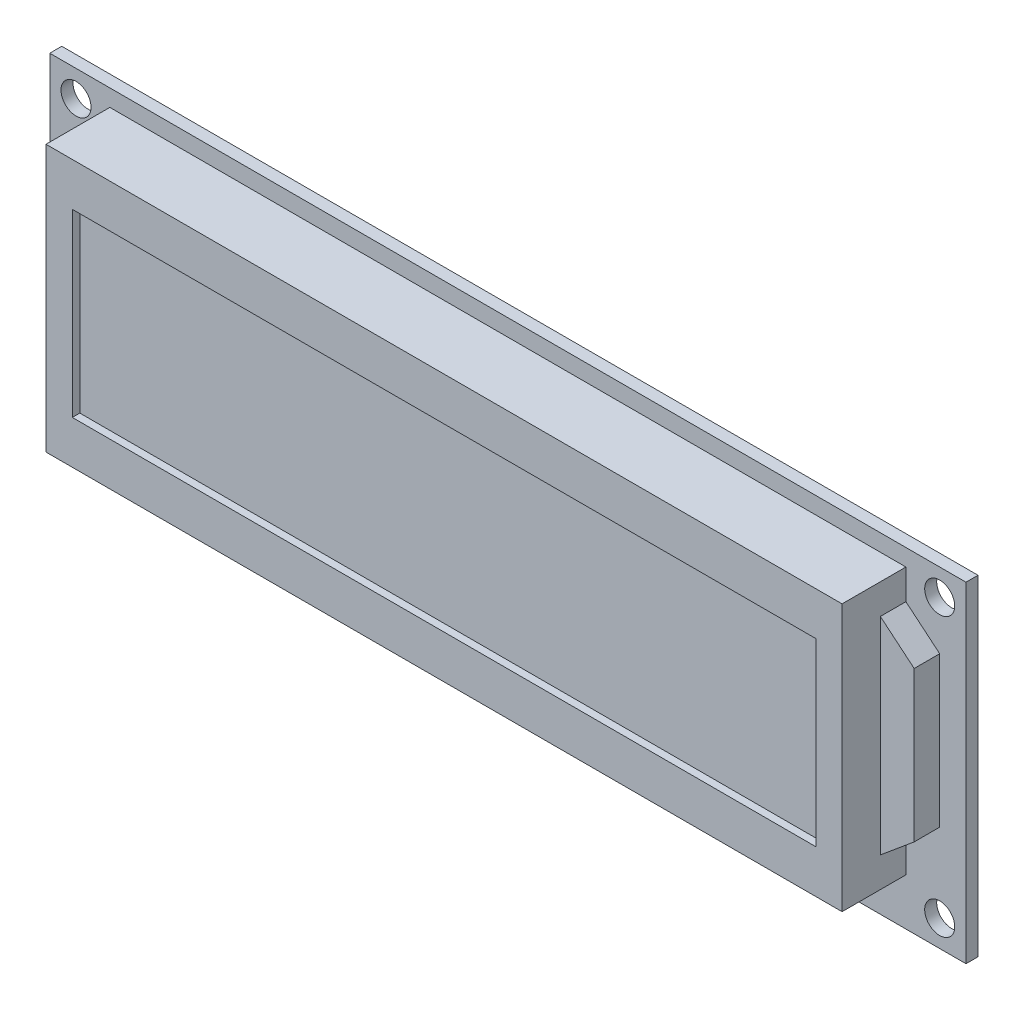
ISO-10303-21;
HEADER;
FILE_DESCRIPTION(('STEP AP214'),'2;1');
FILE_NAME('part.step','',(''),(''),'','','');
FILE_SCHEMA(('AUTOMOTIVE_DESIGN { 1 0 10303 214 1 1 1 1 }'));
ENDSEC;
DATA;
#1=APPLICATION_CONTEXT('core data for automotive mechanical design processes');
#2=APPLICATION_PROTOCOL_DEFINITION('international standard','automotive_design',2000,#1);
#3=PRODUCT_CONTEXT('',#1,'mechanical');
#4=PRODUCT('Part','Part','',(#3));
#5=PRODUCT_RELATED_PRODUCT_CATEGORY('part','',(#4));
#6=PRODUCT_DEFINITION_FORMATION('','',#4);
#7=PRODUCT_DEFINITION_CONTEXT('part definition',#1,'design');
#8=PRODUCT_DEFINITION('design','',#6,#7);
#9=PRODUCT_DEFINITION_SHAPE('','',#8);
#10=(LENGTH_UNIT() NAMED_UNIT(*) SI_UNIT(.MILLI.,.METRE.));
#11=(NAMED_UNIT(*) PLANE_ANGLE_UNIT() SI_UNIT($,.RADIAN.));
#12=(NAMED_UNIT(*) SI_UNIT($,.STERADIAN.) SOLID_ANGLE_UNIT());
#13=UNCERTAINTY_MEASURE_WITH_UNIT(LENGTH_MEASURE(1.E-05),#10,'distance_accuracy_value','');
#14=(GEOMETRIC_REPRESENTATION_CONTEXT(3) GLOBAL_UNCERTAINTY_ASSIGNED_CONTEXT((#13)) GLOBAL_UNIT_ASSIGNED_CONTEXT((#10,
#11,#12)) REPRESENTATION_CONTEXT('',''));
#15=CARTESIAN_POINT('',(0.,0.,0.));
#16=DIRECTION('',(0.,0.,1.));
#17=DIRECTION('',(1.,0.,0.));
#18=AXIS2_PLACEMENT_3D('',#15,#16,#17);
#19=CARTESIAN_POINT('',(0.,0.,1.6));
#20=DIRECTION('',(0.,0.,1.));
#21=DIRECTION('',(1.,0.,0.));
#22=AXIS2_PLACEMENT_3D('',#19,#20,#21);
#23=PLANE('',#22);
#24=CARTESIAN_POINT('',(57.5,18.5,1.6));
#25=DIRECTION('',(0.,0.,1.));
#26=DIRECTION('',(1.,0.,0.));
#27=AXIS2_PLACEMENT_3D('',#24,#25,#26);
#28=CIRCLE('',#27,2.);
#29=CARTESIAN_POINT('',(59.5,18.5,1.6));
#30=VERTEX_POINT('',#29);
#31=EDGE_CURVE('E240',#30,#30,#28,.T.);
#32=ORIENTED_EDGE('',*,*,#31,.F.);
#33=EDGE_LOOP('',(#32));
#34=FACE_BOUND('',#33,.T.);
#35=CARTESIAN_POINT('',(-57.5,18.5,1.6));
#36=DIRECTION('',(0.,0.,1.));
#37=DIRECTION('',(1.,0.,0.));
#38=AXIS2_PLACEMENT_3D('',#35,#36,#37);
#39=CIRCLE('',#38,2.);
#40=CARTESIAN_POINT('',(-55.5,18.5,1.6));
#41=VERTEX_POINT('',#40);
#42=EDGE_CURVE('E252',#41,#41,#39,.T.);
#43=ORIENTED_EDGE('',*,*,#42,.F.);
#44=EDGE_LOOP('',(#43));
#45=FACE_BOUND('',#44,.T.);
#46=DIRECTION('',(0.,-1.,0.));
#47=VECTOR('',#46,1.);
#48=CARTESIAN_POINT('',(-61.,-22.,1.6));
#49=LINE('',#48,#47);
#50=CARTESIAN_POINT('',(-61.,22.,1.6));
#51=VERTEX_POINT('',#50);
#52=CARTESIAN_POINT('',(-61.,-22.,1.6));
#53=VERTEX_POINT('',#52);
#54=EDGE_CURVE('E258',#51,#53,#49,.T.);
#55=ORIENTED_EDGE('',*,*,#54,.T.);
#56=DIRECTION('',(1.,0.,0.));
#57=VECTOR('',#56,1.);
#58=CARTESIAN_POINT('',(61.,-22.,1.6));
#59=LINE('',#58,#57);
#60=CARTESIAN_POINT('',(61.,-22.,1.6));
#61=VERTEX_POINT('',#60);
#62=EDGE_CURVE('E261',#53,#61,#59,.T.);
#63=ORIENTED_EDGE('',*,*,#62,.T.);
#64=DIRECTION('',(0.,1.,0.));
#65=VECTOR('',#64,1.);
#66=CARTESIAN_POINT('',(61.,-22.,1.6));
#67=LINE('',#66,#65);
#68=CARTESIAN_POINT('',(61.,22.,1.6));
#69=VERTEX_POINT('',#68);
#70=EDGE_CURVE('E264',#61,#69,#67,.T.);
#71=ORIENTED_EDGE('',*,*,#70,.T.);
#72=DIRECTION('',(-1.,0.,0.));
#73=VECTOR('',#72,1.);
#74=CARTESIAN_POINT('',(61.,22.,1.6));
#75=LINE('',#74,#73);
#76=EDGE_CURVE('E266',#69,#51,#75,.T.);
#77=ORIENTED_EDGE('',*,*,#76,.T.);
#78=EDGE_LOOP('',(#55,#63,#71,#77));
#79=FACE_BOUND('',#78,.T.);
#80=CARTESIAN_POINT('',(-57.5,-18.5,1.6));
#81=DIRECTION('',(0.,0.,1.));
#82=DIRECTION('',(1.,0.,0.));
#83=AXIS2_PLACEMENT_3D('',#80,#81,#82);
#84=CIRCLE('',#83,2.);
#85=CARTESIAN_POINT('',(-55.5,-18.5,1.6));
#86=VERTEX_POINT('',#85);
#87=EDGE_CURVE('E246',#86,#86,#84,.T.);
#88=ORIENTED_EDGE('',*,*,#87,.F.);
#89=EDGE_LOOP('',(#88));
#90=FACE_BOUND('',#89,.T.);
#91=CARTESIAN_POINT('',(57.5,-18.5,1.6));
#92=DIRECTION('',(0.,0.,1.));
#93=DIRECTION('',(1.,0.,0.));
#94=AXIS2_PLACEMENT_3D('',#91,#92,#93);
#95=CIRCLE('',#94,2.);
#96=CARTESIAN_POINT('',(59.5,-18.5,1.6));
#97=VERTEX_POINT('',#96);
#98=EDGE_CURVE('E234',#97,#97,#95,.T.);
#99=ORIENTED_EDGE('',*,*,#98,.F.);
#100=EDGE_LOOP('',(#99));
#101=FACE_BOUND('',#100,.T.);
#102=DIRECTION('',(0.,1.,0.));
#103=VECTOR('',#102,1.);
#104=CARTESIAN_POINT('',(53.,-15.75,1.6));
#105=LINE('',#104,#103);
#106=CARTESIAN_POINT('',(53.,15.75,1.6));
#107=VERTEX_POINT('',#106);
#108=CARTESIAN_POINT('',(53.,19.75,1.6));
#109=VERTEX_POINT('',#108);
#110=EDGE_CURVE('E221',#107,#109,#105,.T.);
#111=ORIENTED_EDGE('',*,*,#110,.F.);
#112=DIRECTION('',(-0.768221279597376,0.64018439966448,0.));
#113=VECTOR('',#112,1.);
#114=CARTESIAN_POINT('',(53.,15.75,1.6));
#115=LINE('',#114,#113);
#116=CARTESIAN_POINT('',(57.5,12.,1.6));
#117=VERTEX_POINT('',#116);
#118=EDGE_CURVE('E542',#117,#107,#115,.T.);
#119=ORIENTED_EDGE('',*,*,#118,.F.);
#120=DIRECTION('',(0.,1.,0.));
#121=VECTOR('',#120,1.);
#122=CARTESIAN_POINT('',(57.5,12.,1.6));
#123=LINE('',#122,#121);
#124=CARTESIAN_POINT('',(57.5,-8.,1.6));
#125=VERTEX_POINT('',#124);
#126=EDGE_CURVE('E536',#125,#117,#123,.T.);
#127=ORIENTED_EDGE('',*,*,#126,.F.);
#128=DIRECTION('',(0.768221279597376,0.64018439966448,0.));
#129=VECTOR('',#128,1.);
#130=CARTESIAN_POINT('',(53.,-11.75,1.6));
#131=LINE('',#130,#129);
#132=CARTESIAN_POINT('',(53.,-11.75,1.6));
#133=VERTEX_POINT('',#132);
#134=EDGE_CURVE('E540',#133,#125,#131,.T.);
#135=ORIENTED_EDGE('',*,*,#134,.F.);
#136=CARTESIAN_POINT('',(53.,-15.75,1.6));
#137=VERTEX_POINT('',#136);
#138=EDGE_CURVE('E168',#137,#133,#105,.T.);
#139=ORIENTED_EDGE('',*,*,#138,.F.);
#140=DIRECTION('',(1.,0.,0.));
#141=VECTOR('',#140,1.);
#142=CARTESIAN_POINT('',(53.,-15.75,1.6));
#143=LINE('',#142,#141);
#144=CARTESIAN_POINT('',(-53.,-15.75,1.6));
#145=VERTEX_POINT('',#144);
#146=EDGE_CURVE('E219',#145,#137,#143,.T.);
#147=ORIENTED_EDGE('',*,*,#146,.F.);
#148=DIRECTION('',(0.,-1.,0.));
#149=VECTOR('',#148,1.);
#150=CARTESIAN_POINT('',(-53.,-15.75,1.6));
#151=LINE('',#150,#149);
#152=CARTESIAN_POINT('',(-53.,19.75,1.6));
#153=VERTEX_POINT('',#152);
#154=EDGE_CURVE('E200',#153,#145,#151,.T.);
#155=ORIENTED_EDGE('',*,*,#154,.F.);
#156=DIRECTION('',(-1.,0.,0.));
#157=VECTOR('',#156,1.);
#158=CARTESIAN_POINT('',(53.,19.75,1.6));
#159=LINE('',#158,#157);
#160=EDGE_CURVE('E210',#109,#153,#159,.T.);
#161=ORIENTED_EDGE('',*,*,#160,.F.);
#162=EDGE_LOOP('',(#111,#119,#127,#135,#139,#147,#155,#161));
#163=FACE_BOUND('',#162,.T.);
#164=ADVANCED_FACE('F33',(#34,#45,#79,#90,#101,#163),#23,.T.);
#165=CARTESIAN_POINT('',(53.,-15.75,10.1));
#166=DIRECTION('',(-1.,0.,0.));
#167=DIRECTION('',(0.,-1.,0.));
#168=AXIS2_PLACEMENT_3D('',#165,#166,#167);
#169=PLANE('',#168);
#170=DIRECTION('',(0.,0.,-1.));
#171=VECTOR('',#170,1.);
#172=CARTESIAN_POINT('',(53.,15.75,5.));
#173=LINE('',#172,#171);
#174=CARTESIAN_POINT('',(53.,15.75,5.));
#175=VERTEX_POINT('',#174);
#176=EDGE_CURVE('E48',#175,#107,#173,.T.);
#177=ORIENTED_EDGE('',*,*,#176,.T.);
#178=ORIENTED_EDGE('',*,*,#110,.T.);
#179=DIRECTION('',(0.,0.,-1.));
#180=VECTOR('',#179,1.);
#181=CARTESIAN_POINT('',(53.,19.75,10.1));
#182=LINE('',#181,#180);
#183=CARTESIAN_POINT('',(53.,19.75,10.1));
#184=VERTEX_POINT('',#183);
#185=EDGE_CURVE('E226',#184,#109,#182,.T.);
#186=ORIENTED_EDGE('',*,*,#185,.F.);
#187=DIRECTION('',(0.,1.,0.));
#188=VECTOR('',#187,1.);
#189=CARTESIAN_POINT('',(53.,-15.75,10.1));
#190=LINE('',#189,#188);
#191=CARTESIAN_POINT('',(53.,-15.75,10.1));
#192=VERTEX_POINT('',#191);
#193=EDGE_CURVE('E212',#192,#184,#190,.T.);
#194=ORIENTED_EDGE('',*,*,#193,.F.);
#195=DIRECTION('',(0.,0.,-1.));
#196=VECTOR('',#195,1.);
#197=CARTESIAN_POINT('',(53.,-15.75,10.1));
#198=LINE('',#197,#196);
#199=EDGE_CURVE('E229',#192,#137,#198,.T.);
#200=ORIENTED_EDGE('',*,*,#199,.T.);
#201=ORIENTED_EDGE('',*,*,#138,.T.);
#202=DIRECTION('',(0.,0.,-1.));
#203=VECTOR('',#202,1.);
#204=CARTESIAN_POINT('',(53.,-11.75,5.));
#205=LINE('',#204,#203);
#206=CARTESIAN_POINT('',(53.,-11.75,5.));
#207=VERTEX_POINT('',#206);
#208=EDGE_CURVE('E157',#207,#133,#205,.T.);
#209=ORIENTED_EDGE('',*,*,#208,.F.);
#210=DIRECTION('',(0.,-1.,0.));
#211=VECTOR('',#210,1.);
#212=CARTESIAN_POINT('',(53.,15.75,5.));
#213=LINE('',#212,#211);
#214=EDGE_CURVE('E146',#175,#207,#213,.T.);
#215=ORIENTED_EDGE('',*,*,#214,.F.);
#216=EDGE_LOOP('',(#177,#178,#186,#194,#200,#201,#209,#215));
#217=FACE_BOUND('',#216,.T.);
#218=ADVANCED_FACE('F165',(#217),#169,.F.);
#219=CARTESIAN_POINT('',(0.,0.,0.));
#220=DIRECTION('',(0.,0.,1.));
#221=DIRECTION('',(1.,0.,0.));
#222=AXIS2_PLACEMENT_3D('',#219,#220,#221);
#223=PLANE('',#222);
#224=DIRECTION('',(0.,-1.,0.));
#225=VECTOR('',#224,1.);
#226=CARTESIAN_POINT('',(-61.,-22.,0.));
#227=LINE('',#226,#225);
#228=CARTESIAN_POINT('',(-61.,22.,0.));
#229=VERTEX_POINT('',#228);
#230=CARTESIAN_POINT('',(-61.,-22.,0.));
#231=VERTEX_POINT('',#230);
#232=EDGE_CURVE('E255',#229,#231,#227,.T.);
#233=ORIENTED_EDGE('',*,*,#232,.F.);
#234=DIRECTION('',(-1.,0.,0.));
#235=VECTOR('',#234,1.);
#236=CARTESIAN_POINT('',(61.,22.,0.));
#237=LINE('',#236,#235);
#238=CARTESIAN_POINT('',(61.,22.,0.));
#239=VERTEX_POINT('',#238);
#240=EDGE_CURVE('E262',#239,#229,#237,.T.);
#241=ORIENTED_EDGE('',*,*,#240,.F.);
#242=DIRECTION('',(0.,1.,0.));
#243=VECTOR('',#242,1.);
#244=CARTESIAN_POINT('',(61.,-22.,0.));
#245=LINE('',#244,#243);
#246=CARTESIAN_POINT('',(61.,-22.,0.));
#247=VERTEX_POINT('',#246);
#248=EDGE_CURVE('E273',#247,#239,#245,.T.);
#249=ORIENTED_EDGE('',*,*,#248,.F.);
#250=DIRECTION('',(1.,0.,0.));
#251=VECTOR('',#250,1.);
#252=CARTESIAN_POINT('',(61.,-22.,0.));
#253=LINE('',#252,#251);
#254=EDGE_CURVE('E271',#231,#247,#253,.T.);
#255=ORIENTED_EDGE('',*,*,#254,.F.);
#256=EDGE_LOOP('',(#233,#241,#249,#255));
#257=FACE_BOUND('',#256,.T.);
#258=CARTESIAN_POINT('',(-57.5,18.5,0.));
#259=DIRECTION('',(0.,0.,1.));
#260=DIRECTION('',(1.,0.,0.));
#261=AXIS2_PLACEMENT_3D('',#258,#259,#260);
#262=CIRCLE('',#261,2.);
#263=CARTESIAN_POINT('',(-55.5,18.5,0.));
#264=VERTEX_POINT('',#263);
#265=EDGE_CURVE('E249',#264,#264,#262,.T.);
#266=ORIENTED_EDGE('',*,*,#265,.T.);
#267=EDGE_LOOP('',(#266));
#268=FACE_BOUND('',#267,.T.);
#269=CARTESIAN_POINT('',(-57.5,-18.5,0.));
#270=DIRECTION('',(0.,0.,1.));
#271=DIRECTION('',(1.,0.,0.));
#272=AXIS2_PLACEMENT_3D('',#269,#270,#271);
#273=CIRCLE('',#272,2.);
#274=CARTESIAN_POINT('',(-55.5,-18.5,0.));
#275=VERTEX_POINT('',#274);
#276=EDGE_CURVE('E243',#275,#275,#273,.T.);
#277=ORIENTED_EDGE('',*,*,#276,.T.);
#278=EDGE_LOOP('',(#277));
#279=FACE_BOUND('',#278,.T.);
#280=CARTESIAN_POINT('',(57.5,18.5,0.));
#281=DIRECTION('',(0.,0.,1.));
#282=DIRECTION('',(1.,0.,0.));
#283=AXIS2_PLACEMENT_3D('',#280,#281,#282);
#284=CIRCLE('',#283,2.);
#285=CARTESIAN_POINT('',(59.5,18.5,0.));
#286=VERTEX_POINT('',#285);
#287=EDGE_CURVE('E237',#286,#286,#284,.T.);
#288=ORIENTED_EDGE('',*,*,#287,.T.);
#289=EDGE_LOOP('',(#288));
#290=FACE_BOUND('',#289,.T.);
#291=CARTESIAN_POINT('',(57.5,-18.5,0.));
#292=DIRECTION('',(0.,0.,1.));
#293=DIRECTION('',(1.,0.,0.));
#294=AXIS2_PLACEMENT_3D('',#291,#292,#293);
#295=CIRCLE('',#294,2.);
#296=CARTESIAN_POINT('',(59.5,-18.5,0.));
#297=VERTEX_POINT('',#296);
#298=EDGE_CURVE('E233',#297,#297,#295,.T.);
#299=ORIENTED_EDGE('',*,*,#298,.T.);
#300=EDGE_LOOP('',(#299));
#301=FACE_BOUND('',#300,.T.);
#302=ADVANCED_FACE('F291',(#257,#268,#279,#290,#301),#223,.F.);
#303=CARTESIAN_POINT('',(-61.,-22.,1.6));
#304=DIRECTION('',(1.,0.,0.));
#305=DIRECTION('',(0.,0.,-1.));
#306=AXIS2_PLACEMENT_3D('',#303,#304,#305);
#307=PLANE('',#306);
#308=ORIENTED_EDGE('',*,*,#232,.T.);
#309=DIRECTION('',(0.,0.,-1.));
#310=VECTOR('',#309,1.);
#311=CARTESIAN_POINT('',(-61.,-22.,1.6));
#312=LINE('',#311,#310);
#313=EDGE_CURVE('E11',#53,#231,#312,.T.);
#314=ORIENTED_EDGE('',*,*,#313,.F.);
#315=ORIENTED_EDGE('',*,*,#54,.F.);
#316=DIRECTION('',(0.,0.,-1.));
#317=VECTOR('',#316,1.);
#318=CARTESIAN_POINT('',(-61.,22.,1.6));
#319=LINE('',#318,#317);
#320=EDGE_CURVE('E268',#51,#229,#319,.T.);
#321=ORIENTED_EDGE('',*,*,#320,.T.);
#322=EDGE_LOOP('',(#308,#314,#315,#321));
#323=FACE_BOUND('',#322,.T.);
#324=ADVANCED_FACE('F35',(#323),#307,.F.);
#325=CARTESIAN_POINT('',(61.,-22.,1.6));
#326=DIRECTION('',(0.,1.,0.));
#327=DIRECTION('',(-1.,0.,0.));
#328=AXIS2_PLACEMENT_3D('',#325,#326,#327);
#329=PLANE('',#328);
#330=ORIENTED_EDGE('',*,*,#254,.T.);
#331=DIRECTION('',(0.,0.,-1.));
#332=VECTOR('',#331,1.);
#333=CARTESIAN_POINT('',(61.,-22.,1.6));
#334=LINE('',#333,#332);
#335=EDGE_CURVE('E41',#61,#247,#334,.T.);
#336=ORIENTED_EDGE('',*,*,#335,.F.);
#337=ORIENTED_EDGE('',*,*,#62,.F.);
#338=ORIENTED_EDGE('',*,*,#313,.T.);
#339=EDGE_LOOP('',(#330,#336,#337,#338));
#340=FACE_BOUND('',#339,.T.);
#341=ADVANCED_FACE('F302',(#340),#329,.F.);
#342=CARTESIAN_POINT('',(61.,-22.,1.6));
#343=DIRECTION('',(-1.,0.,0.));
#344=DIRECTION('',(0.,-1.,0.));
#345=AXIS2_PLACEMENT_3D('',#342,#343,#344);
#346=PLANE('',#345);
#347=ORIENTED_EDGE('',*,*,#248,.T.);
#348=DIRECTION('',(0.,0.,-1.));
#349=VECTOR('',#348,1.);
#350=CARTESIAN_POINT('',(61.,22.,1.6));
#351=LINE('',#350,#349);
#352=EDGE_CURVE('E278',#69,#239,#351,.T.);
#353=ORIENTED_EDGE('',*,*,#352,.F.);
#354=ORIENTED_EDGE('',*,*,#70,.F.);
#355=ORIENTED_EDGE('',*,*,#335,.T.);
#356=EDGE_LOOP('',(#347,#353,#354,#355));
#357=FACE_BOUND('',#356,.T.);
#358=ADVANCED_FACE('F285',(#357),#346,.F.);
#359=CARTESIAN_POINT('',(61.,22.,1.6));
#360=DIRECTION('',(0.,-1.,0.));
#361=DIRECTION('',(1.,0.,0.));
#362=AXIS2_PLACEMENT_3D('',#359,#360,#361);
#363=PLANE('',#362);
#364=ORIENTED_EDGE('',*,*,#240,.T.);
#365=ORIENTED_EDGE('',*,*,#320,.F.);
#366=ORIENTED_EDGE('',*,*,#76,.F.);
#367=ORIENTED_EDGE('',*,*,#352,.T.);
#368=EDGE_LOOP('',(#364,#365,#366,#367));
#369=FACE_BOUND('',#368,.T.);
#370=ADVANCED_FACE('F295',(#369),#363,.F.);
#371=CARTESIAN_POINT('',(-57.5,18.5,1.6));
#372=DIRECTION('',(0.,0.,-1.));
#373=DIRECTION('',(-1.,0.,0.));
#374=AXIS2_PLACEMENT_3D('',#371,#372,#373);
#375=CYLINDRICAL_SURFACE('',#374,2.);
#376=ORIENTED_EDGE('',*,*,#42,.T.);
#377=EDGE_LOOP('',(#376));
#378=FACE_BOUND('',#377,.T.);
#379=ORIENTED_EDGE('',*,*,#265,.F.);
#380=EDGE_LOOP('',(#379));
#381=FACE_BOUND('',#380,.T.);
#382=ADVANCED_FACE('F320',(#378,#381),#375,.F.);
#383=CARTESIAN_POINT('',(-57.5,-18.5,1.6));
#384=DIRECTION('',(0.,0.,-1.));
#385=DIRECTION('',(-1.,0.,0.));
#386=AXIS2_PLACEMENT_3D('',#383,#384,#385);
#387=CYLINDRICAL_SURFACE('',#386,2.);
#388=ORIENTED_EDGE('',*,*,#87,.T.);
#389=EDGE_LOOP('',(#388));
#390=FACE_BOUND('',#389,.T.);
#391=ORIENTED_EDGE('',*,*,#276,.F.);
#392=EDGE_LOOP('',(#391));
#393=FACE_BOUND('',#392,.T.);
#394=ADVANCED_FACE('F328',(#390,#393),#387,.F.);
#395=CARTESIAN_POINT('',(57.5,18.5,1.6));
#396=DIRECTION('',(0.,0.,-1.));
#397=DIRECTION('',(-1.,0.,0.));
#398=AXIS2_PLACEMENT_3D('',#395,#396,#397);
#399=CYLINDRICAL_SURFACE('',#398,2.);
#400=ORIENTED_EDGE('',*,*,#31,.T.);
#401=EDGE_LOOP('',(#400));
#402=FACE_BOUND('',#401,.T.);
#403=ORIENTED_EDGE('',*,*,#287,.F.);
#404=EDGE_LOOP('',(#403));
#405=FACE_BOUND('',#404,.T.);
#406=ADVANCED_FACE('F333',(#402,#405),#399,.F.);
#407=CARTESIAN_POINT('',(57.5,-18.5,1.6));
#408=DIRECTION('',(0.,0.,-1.));
#409=DIRECTION('',(-1.,0.,0.));
#410=AXIS2_PLACEMENT_3D('',#407,#408,#409);
#411=CYLINDRICAL_SURFACE('',#410,2.);
#412=ORIENTED_EDGE('',*,*,#98,.T.);
#413=EDGE_LOOP('',(#412));
#414=FACE_BOUND('',#413,.T.);
#415=ORIENTED_EDGE('',*,*,#298,.F.);
#416=EDGE_LOOP('',(#415));
#417=FACE_BOUND('',#416,.T.);
#418=ADVANCED_FACE('F345',(#414,#417),#411,.F.);
#419=CARTESIAN_POINT('',(-53.,-15.75,10.1));
#420=DIRECTION('',(1.,0.,0.));
#421=DIRECTION('',(0.,0.,-1.));
#422=AXIS2_PLACEMENT_3D('',#419,#420,#421);
#423=PLANE('',#422);
#424=ORIENTED_EDGE('',*,*,#154,.T.);
#425=DIRECTION('',(0.,0.,-1.));
#426=VECTOR('',#425,1.);
#427=CARTESIAN_POINT('',(-53.,-15.75,10.1));
#428=LINE('',#427,#426);
#429=CARTESIAN_POINT('',(-53.,-15.75,10.1));
#430=VERTEX_POINT('',#429);
#431=EDGE_CURVE('E231',#430,#145,#428,.T.);
#432=ORIENTED_EDGE('',*,*,#431,.F.);
#433=DIRECTION('',(0.,-1.,0.));
#434=VECTOR('',#433,1.);
#435=CARTESIAN_POINT('',(-53.,-15.75,10.1));
#436=LINE('',#435,#434);
#437=CARTESIAN_POINT('',(-53.,19.75,10.1));
#438=VERTEX_POINT('',#437);
#439=EDGE_CURVE('E206',#438,#430,#436,.T.);
#440=ORIENTED_EDGE('',*,*,#439,.F.);
#441=DIRECTION('',(0.,0.,-1.));
#442=VECTOR('',#441,1.);
#443=CARTESIAN_POINT('',(-53.,19.75,10.1));
#444=LINE('',#443,#442);
#445=EDGE_CURVE('E216',#438,#153,#444,.T.);
#446=ORIENTED_EDGE('',*,*,#445,.T.);
#447=EDGE_LOOP('',(#424,#432,#440,#446));
#448=FACE_BOUND('',#447,.T.);
#449=ADVANCED_FACE('F347',(#448),#423,.F.);
#450=CARTESIAN_POINT('',(53.,-15.75,10.1));
#451=DIRECTION('',(0.,1.,0.));
#452=DIRECTION('',(-1.,0.,0.));
#453=AXIS2_PLACEMENT_3D('',#450,#451,#452);
#454=PLANE('',#453);
#455=ORIENTED_EDGE('',*,*,#146,.T.);
#456=ORIENTED_EDGE('',*,*,#199,.F.);
#457=DIRECTION('',(1.,0.,0.));
#458=VECTOR('',#457,1.);
#459=CARTESIAN_POINT('',(53.,-15.75,10.1));
#460=LINE('',#459,#458);
#461=EDGE_CURVE('E209',#430,#192,#460,.T.);
#462=ORIENTED_EDGE('',*,*,#461,.F.);
#463=ORIENTED_EDGE('',*,*,#431,.T.);
#464=EDGE_LOOP('',(#455,#456,#462,#463));
#465=FACE_BOUND('',#464,.T.);
#466=ADVANCED_FACE('F354',(#465),#454,.F.);
#467=CARTESIAN_POINT('',(53.,19.75,10.1));
#468=DIRECTION('',(0.,-1.,0.));
#469=DIRECTION('',(1.,0.,0.));
#470=AXIS2_PLACEMENT_3D('',#467,#468,#469);
#471=PLANE('',#470);
#472=ORIENTED_EDGE('',*,*,#160,.T.);
#473=ORIENTED_EDGE('',*,*,#445,.F.);
#474=DIRECTION('',(-1.,0.,0.));
#475=VECTOR('',#474,1.);
#476=CARTESIAN_POINT('',(53.,19.75,10.1));
#477=LINE('',#476,#475);
#478=EDGE_CURVE('E214',#184,#438,#477,.T.);
#479=ORIENTED_EDGE('',*,*,#478,.F.);
#480=ORIENTED_EDGE('',*,*,#185,.T.);
#481=EDGE_LOOP('',(#472,#473,#479,#480));
#482=FACE_BOUND('',#481,.T.);
#483=ADVANCED_FACE('F361',(#482),#471,.F.);
#484=CARTESIAN_POINT('',(0.,0.,10.1));
#485=DIRECTION('',(0.,0.,1.));
#486=DIRECTION('',(1.,0.,0.));
#487=AXIS2_PLACEMENT_3D('',#484,#485,#486);
#488=PLANE('',#487);
#489=DIRECTION('',(0.,-1.,0.));
#490=VECTOR('',#489,1.);
#491=CARTESIAN_POINT('',(-49.5,-10.,10.1));
#492=LINE('',#491,#490);
#493=CARTESIAN_POINT('',(-49.5,14.,10.1));
#494=VERTEX_POINT('',#493);
#495=CARTESIAN_POINT('',(-49.5,-10.,10.1));
#496=VERTEX_POINT('',#495);
#497=EDGE_CURVE('E56',#494,#496,#492,.T.);
#498=ORIENTED_EDGE('',*,*,#497,.F.);
#499=DIRECTION('',(-1.,0.,0.));
#500=VECTOR('',#499,1.);
#501=CARTESIAN_POINT('',(49.5,14.,10.1));
#502=LINE('',#501,#500);
#503=CARTESIAN_POINT('',(49.5,14.,10.1));
#504=VERTEX_POINT('',#503);
#505=EDGE_CURVE('E179',#504,#494,#502,.T.);
#506=ORIENTED_EDGE('',*,*,#505,.F.);
#507=DIRECTION('',(0.,1.,0.));
#508=VECTOR('',#507,1.);
#509=CARTESIAN_POINT('',(49.5,-9.99999999999999,10.1));
#510=LINE('',#509,#508);
#511=CARTESIAN_POINT('',(49.5,-9.99999999999999,10.1));
#512=VERTEX_POINT('',#511);
#513=EDGE_CURVE('E193',#512,#504,#510,.T.);
#514=ORIENTED_EDGE('',*,*,#513,.F.);
#515=DIRECTION('',(1.,0.,0.));
#516=VECTOR('',#515,1.);
#517=CARTESIAN_POINT('',(49.5,-9.99999999999999,10.1));
#518=LINE('',#517,#516);
#519=EDGE_CURVE('E190',#496,#512,#518,.T.);
#520=ORIENTED_EDGE('',*,*,#519,.F.);
#521=EDGE_LOOP('',(#498,#506,#514,#520));
#522=FACE_BOUND('',#521,.T.);
#523=ORIENTED_EDGE('',*,*,#439,.T.);
#524=ORIENTED_EDGE('',*,*,#461,.T.);
#525=ORIENTED_EDGE('',*,*,#193,.T.);
#526=ORIENTED_EDGE('',*,*,#478,.T.);
#527=EDGE_LOOP('',(#523,#524,#525,#526));
#528=FACE_BOUND('',#527,.T.);
#529=ADVANCED_FACE('F366',(#522,#528),#488,.T.);
#530=CARTESIAN_POINT('',(-49.5,-10.,9.1));
#531=DIRECTION('',(-1.,0.,0.));
#532=DIRECTION('',(0.,0.,1.));
#533=AXIS2_PLACEMENT_3D('',#530,#531,#532);
#534=PLANE('',#533);
#535=ORIENTED_EDGE('',*,*,#497,.T.);
#536=DIRECTION('',(0.,0.,1.));
#537=VECTOR('',#536,1.);
#538=CARTESIAN_POINT('',(-49.5,-10.,9.1));
#539=LINE('',#538,#537);
#540=CARTESIAN_POINT('',(-49.5,-10.,9.1));
#541=VERTEX_POINT('',#540);
#542=EDGE_CURVE('E188',#541,#496,#539,.T.);
#543=ORIENTED_EDGE('',*,*,#542,.F.);
#544=DIRECTION('',(0.,-1.,0.));
#545=VECTOR('',#544,1.);
#546=CARTESIAN_POINT('',(-49.5,-10.,9.1));
#547=LINE('',#546,#545);
#548=CARTESIAN_POINT('',(-49.5,14.,9.1));
#549=VERTEX_POINT('',#548);
#550=EDGE_CURVE('E175',#549,#541,#547,.T.);
#551=ORIENTED_EDGE('',*,*,#550,.F.);
#552=DIRECTION('',(0.,0.,1.));
#553=VECTOR('',#552,1.);
#554=CARTESIAN_POINT('',(-49.5,14.,9.1));
#555=LINE('',#554,#553);
#556=EDGE_CURVE('E198',#549,#494,#555,.T.);
#557=ORIENTED_EDGE('',*,*,#556,.T.);
#558=EDGE_LOOP('',(#535,#543,#551,#557));
#559=FACE_BOUND('',#558,.T.);
#560=ADVANCED_FACE('F370',(#559),#534,.F.);
#561=CARTESIAN_POINT('',(49.5,14.,9.1));
#562=DIRECTION('',(0.,1.,0.));
#563=DIRECTION('',(-1.,0.,0.));
#564=AXIS2_PLACEMENT_3D('',#561,#562,#563);
#565=PLANE('',#564);
#566=ORIENTED_EDGE('',*,*,#505,.T.);
#567=ORIENTED_EDGE('',*,*,#556,.F.);
#568=DIRECTION('',(-1.,0.,0.));
#569=VECTOR('',#568,1.);
#570=CARTESIAN_POINT('',(49.5,14.,9.1));
#571=LINE('',#570,#569);
#572=CARTESIAN_POINT('',(49.5,14.,9.1));
#573=VERTEX_POINT('',#572);
#574=EDGE_CURVE('E185',#573,#549,#571,.T.);
#575=ORIENTED_EDGE('',*,*,#574,.F.);
#576=DIRECTION('',(0.,0.,1.));
#577=VECTOR('',#576,1.);
#578=CARTESIAN_POINT('',(49.5,14.,9.1));
#579=LINE('',#578,#577);
#580=EDGE_CURVE('E201',#573,#504,#579,.T.);
#581=ORIENTED_EDGE('',*,*,#580,.T.);
#582=EDGE_LOOP('',(#566,#567,#575,#581));
#583=FACE_BOUND('',#582,.T.);
#584=ADVANCED_FACE('F374',(#583),#565,.F.);
#585=CARTESIAN_POINT('',(49.5,-9.99999999999999,9.1));
#586=DIRECTION('',(1.,0.,0.));
#587=DIRECTION('',(0.,0.,-1.));
#588=AXIS2_PLACEMENT_3D('',#585,#586,#587);
#589=PLANE('',#588);
#590=ORIENTED_EDGE('',*,*,#513,.T.);
#591=ORIENTED_EDGE('',*,*,#580,.F.);
#592=DIRECTION('',(0.,1.,0.));
#593=VECTOR('',#592,1.);
#594=CARTESIAN_POINT('',(49.5,-9.99999999999999,9.1));
#595=LINE('',#594,#593);
#596=CARTESIAN_POINT('',(49.5,-9.99999999999999,9.1));
#597=VERTEX_POINT('',#596);
#598=EDGE_CURVE('E182',#597,#573,#595,.T.);
#599=ORIENTED_EDGE('',*,*,#598,.F.);
#600=DIRECTION('',(0.,0.,1.));
#601=VECTOR('',#600,1.);
#602=CARTESIAN_POINT('',(49.5,-9.99999999999999,9.1));
#603=LINE('',#602,#601);
#604=EDGE_CURVE('E203',#597,#512,#603,.T.);
#605=ORIENTED_EDGE('',*,*,#604,.T.);
#606=EDGE_LOOP('',(#590,#591,#599,#605));
#607=FACE_BOUND('',#606,.T.);
#608=ADVANCED_FACE('F379',(#607),#589,.F.);
#609=CARTESIAN_POINT('',(49.5,-9.99999999999999,9.1));
#610=DIRECTION('',(0.,-1.,0.));
#611=DIRECTION('',(1.,0.,0.));
#612=AXIS2_PLACEMENT_3D('',#609,#610,#611);
#613=PLANE('',#612);
#614=ORIENTED_EDGE('',*,*,#519,.T.);
#615=ORIENTED_EDGE('',*,*,#604,.F.);
#616=DIRECTION('',(1.,0.,0.));
#617=VECTOR('',#616,1.);
#618=CARTESIAN_POINT('',(49.5,-9.99999999999999,9.1));
#619=LINE('',#618,#617);
#620=EDGE_CURVE('E178',#541,#597,#619,.T.);
#621=ORIENTED_EDGE('',*,*,#620,.F.);
#622=ORIENTED_EDGE('',*,*,#542,.T.);
#623=EDGE_LOOP('',(#614,#615,#621,#622));
#624=FACE_BOUND('',#623,.T.);
#625=ADVANCED_FACE('F375',(#624),#613,.F.);
#626=CARTESIAN_POINT('',(0.,0.,9.1));
#627=DIRECTION('',(0.,0.,1.));
#628=DIRECTION('',(1.,0.,0.));
#629=AXIS2_PLACEMENT_3D('',#626,#627,#628);
#630=PLANE('',#629);
#631=ORIENTED_EDGE('',*,*,#550,.T.);
#632=ORIENTED_EDGE('',*,*,#620,.T.);
#633=ORIENTED_EDGE('',*,*,#598,.T.);
#634=ORIENTED_EDGE('',*,*,#574,.T.);
#635=EDGE_LOOP('',(#631,#632,#633,#634));
#636=FACE_BOUND('',#635,.T.);
#637=ADVANCED_FACE('F378',(#636),#630,.T.);
#638=CARTESIAN_POINT('',(53.,15.75,5.));
#639=DIRECTION('',(-0.64018439966448,-0.768221279597376,0.));
#640=DIRECTION('',(0.768221279597376,-0.64018439966448,0.));
#641=AXIS2_PLACEMENT_3D('',#638,#639,#640);
#642=PLANE('',#641);
#643=ORIENTED_EDGE('',*,*,#118,.T.);
#644=ORIENTED_EDGE('',*,*,#176,.F.);
#645=DIRECTION('',(-0.768221279597376,0.64018439966448,0.));
#646=VECTOR('',#645,1.);
#647=CARTESIAN_POINT('',(53.,15.75,5.));
#648=LINE('',#647,#646);
#649=CARTESIAN_POINT('',(57.5,12.,5.));
#650=VERTEX_POINT('',#649);
#651=EDGE_CURVE('E151',#650,#175,#648,.T.);
#652=ORIENTED_EDGE('',*,*,#651,.F.);
#653=DIRECTION('',(0.,0.,-1.));
#654=VECTOR('',#653,1.);
#655=CARTESIAN_POINT('',(57.5,12.,5.));
#656=LINE('',#655,#654);
#657=EDGE_CURVE('E171',#650,#117,#656,.T.);
#658=ORIENTED_EDGE('',*,*,#657,.T.);
#659=EDGE_LOOP('',(#643,#644,#652,#658));
#660=FACE_BOUND('',#659,.T.);
#661=ADVANCED_FACE('F389',(#660),#642,.F.);
#662=CARTESIAN_POINT('',(53.,-11.75,5.));
#663=DIRECTION('',(-0.64018439966448,0.768221279597376,0.));
#664=DIRECTION('',(-0.768221279597376,-0.64018439966448,0.));
#665=AXIS2_PLACEMENT_3D('',#662,#663,#664);
#666=PLANE('',#665);
#667=ORIENTED_EDGE('',*,*,#134,.T.);
#668=DIRECTION('',(0.,0.,-1.));
#669=VECTOR('',#668,1.);
#670=CARTESIAN_POINT('',(57.5,-8.,5.));
#671=LINE('',#670,#669);
#672=CARTESIAN_POINT('',(57.5,-8.,5.));
#673=VERTEX_POINT('',#672);
#674=EDGE_CURVE('E160',#673,#125,#671,.T.);
#675=ORIENTED_EDGE('',*,*,#674,.F.);
#676=DIRECTION('',(0.768221279597376,0.64018439966448,0.));
#677=VECTOR('',#676,1.);
#678=CARTESIAN_POINT('',(53.,-11.75,5.));
#679=LINE('',#678,#677);
#680=EDGE_CURVE('E149',#207,#673,#679,.T.);
#681=ORIENTED_EDGE('',*,*,#680,.F.);
#682=ORIENTED_EDGE('',*,*,#208,.T.);
#683=EDGE_LOOP('',(#667,#675,#681,#682));
#684=FACE_BOUND('',#683,.T.);
#685=ADVANCED_FACE('F156',(#684),#666,.F.);
#686=CARTESIAN_POINT('',(57.5,12.,5.));
#687=DIRECTION('',(-1.,0.,0.));
#688=DIRECTION('',(0.,0.,1.));
#689=AXIS2_PLACEMENT_3D('',#686,#687,#688);
#690=PLANE('',#689);
#691=ORIENTED_EDGE('',*,*,#126,.T.);
#692=ORIENTED_EDGE('',*,*,#657,.F.);
#693=DIRECTION('',(0.,1.,0.));
#694=VECTOR('',#693,1.);
#695=CARTESIAN_POINT('',(57.5,12.,5.));
#696=LINE('',#695,#694);
#697=EDGE_CURVE('E162',#673,#650,#696,.T.);
#698=ORIENTED_EDGE('',*,*,#697,.F.);
#699=ORIENTED_EDGE('',*,*,#674,.T.);
#700=EDGE_LOOP('',(#691,#692,#698,#699));
#701=FACE_BOUND('',#700,.T.);
#702=ADVANCED_FACE('F395',(#701),#690,.F.);
#703=CARTESIAN_POINT('',(0.,0.,5.));
#704=DIRECTION('',(0.,0.,1.));
#705=DIRECTION('',(1.,0.,0.));
#706=AXIS2_PLACEMENT_3D('',#703,#704,#705);
#707=PLANE('',#706);
#708=ORIENTED_EDGE('',*,*,#651,.T.);
#709=ORIENTED_EDGE('',*,*,#214,.T.);
#710=ORIENTED_EDGE('',*,*,#680,.T.);
#711=ORIENTED_EDGE('',*,*,#697,.T.);
#712=EDGE_LOOP('',(#708,#709,#710,#711));
#713=FACE_BOUND('',#712,.T.);
#714=ADVANCED_FACE('F148',(#713),#707,.T.);
#715=CLOSED_SHELL('',(#164,#218,#302,#324,#341,#358,#370,#382,#394,#406,#418,#449,#466,#483,
#529,#560,#584,#608,#625,#637,#661,#685,#702,#714));
#716=MANIFOLD_SOLID_BREP('B2',#715);
#717=ADVANCED_BREP_SHAPE_REPRESENTATION('',(#18,#716),#14);
#718=SHAPE_DEFINITION_REPRESENTATION(#9,#717);
ENDSEC;
END-ISO-10303-21;
